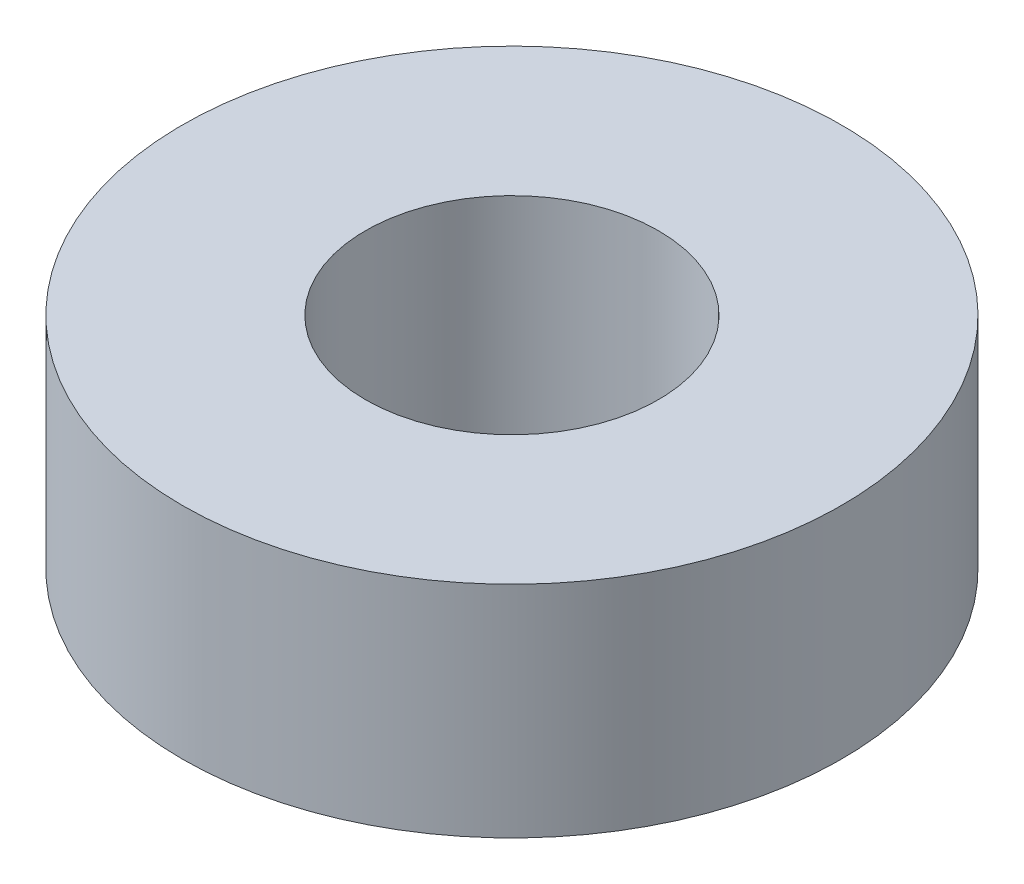
ISO-10303-21;
HEADER;
FILE_DESCRIPTION(('STEP AP214'),'2;1');
FILE_NAME('part.step','',(''),(''),'','','');
FILE_SCHEMA(('AUTOMOTIVE_DESIGN { 1 0 10303 214 1 1 1 1 }'));
ENDSEC;
DATA;
#1=APPLICATION_CONTEXT('core data for automotive mechanical design processes');
#2=APPLICATION_PROTOCOL_DEFINITION('international standard','automotive_design',2000,#1);
#3=PRODUCT_CONTEXT('',#1,'mechanical');
#4=PRODUCT('Part','Part','',(#3));
#5=PRODUCT_RELATED_PRODUCT_CATEGORY('part','',(#4));
#6=PRODUCT_DEFINITION_FORMATION('','',#4);
#7=PRODUCT_DEFINITION_CONTEXT('part definition',#1,'design');
#8=PRODUCT_DEFINITION('design','',#6,#7);
#9=PRODUCT_DEFINITION_SHAPE('','',#8);
#10=(LENGTH_UNIT() NAMED_UNIT(*) SI_UNIT(.MILLI.,.METRE.));
#11=(NAMED_UNIT(*) PLANE_ANGLE_UNIT() SI_UNIT($,.RADIAN.));
#12=(NAMED_UNIT(*) SI_UNIT($,.STERADIAN.) SOLID_ANGLE_UNIT());
#13=UNCERTAINTY_MEASURE_WITH_UNIT(LENGTH_MEASURE(1.E-05),#10,'distance_accuracy_value','');
#14=(GEOMETRIC_REPRESENTATION_CONTEXT(3) GLOBAL_UNCERTAINTY_ASSIGNED_CONTEXT((#13)) GLOBAL_UNIT_ASSIGNED_CONTEXT((#10,
#11,#12)) REPRESENTATION_CONTEXT('',''));
#15=CARTESIAN_POINT('',(0.,0.,0.));
#16=DIRECTION('',(0.,0.,1.));
#17=DIRECTION('',(1.,0.,0.));
#18=AXIS2_PLACEMENT_3D('',#15,#16,#17);
#19=CARTESIAN_POINT('',(0.,15.,0.));
#20=DIRECTION('',(0.,-1.,0.));
#21=DIRECTION('',(0.,0.,-1.));
#22=AXIS2_PLACEMENT_3D('',#19,#20,#21);
#23=CYLINDRICAL_SURFACE('',#22,22.5);
#24=CARTESIAN_POINT('',(0.,15.,0.));
#25=DIRECTION('',(0.,1.,0.));
#26=DIRECTION('',(0.,0.,1.));
#27=AXIS2_PLACEMENT_3D('',#24,#25,#26);
#28=CIRCLE('',#27,22.5);
#29=CARTESIAN_POINT('',(0.,15.,22.5));
#30=VERTEX_POINT('',#29);
#31=EDGE_CURVE('E10',#30,#30,#28,.T.);
#32=ORIENTED_EDGE('',*,*,#31,.F.);
#33=EDGE_LOOP('',(#32));
#34=FACE_BOUND('',#33,.T.);
#35=CARTESIAN_POINT('',(0.,0.,0.));
#36=DIRECTION('',(0.,1.,0.));
#37=DIRECTION('',(0.,0.,1.));
#38=AXIS2_PLACEMENT_3D('',#35,#36,#37);
#39=CIRCLE('',#38,22.5);
#40=CARTESIAN_POINT('',(0.,0.,22.5));
#41=VERTEX_POINT('',#40);
#42=EDGE_CURVE('E37',#41,#41,#39,.T.);
#43=ORIENTED_EDGE('',*,*,#42,.T.);
#44=EDGE_LOOP('',(#43));
#45=FACE_BOUND('',#44,.T.);
#46=ADVANCED_FACE('F40',(#34,#45),#23,.T.);
#47=CARTESIAN_POINT('',(0.,15.,0.));
#48=DIRECTION('',(0.,1.,0.));
#49=DIRECTION('',(0.,0.,1.));
#50=AXIS2_PLACEMENT_3D('',#47,#48,#49);
#51=PLANE('',#50);
#52=CARTESIAN_POINT('',(0.,15.,0.));
#53=DIRECTION('',(0.,1.,0.));
#54=DIRECTION('',(0.,0.,1.));
#55=AXIS2_PLACEMENT_3D('',#52,#53,#54);
#56=CIRCLE('',#55,10.);
#57=CARTESIAN_POINT('',(0.,15.,10.));
#58=VERTEX_POINT('',#57);
#59=EDGE_CURVE('E50',#58,#58,#56,.T.);
#60=ORIENTED_EDGE('',*,*,#59,.F.);
#61=EDGE_LOOP('',(#60));
#62=FACE_BOUND('',#61,.T.);
#63=ORIENTED_EDGE('',*,*,#31,.T.);
#64=EDGE_LOOP('',(#63));
#65=FACE_BOUND('',#64,.T.);
#66=ADVANCED_FACE('F59',(#62,#65),#51,.T.);
#67=CARTESIAN_POINT('',(0.,0.,0.));
#68=DIRECTION('',(0.,1.,0.));
#69=DIRECTION('',(0.,0.,1.));
#70=AXIS2_PLACEMENT_3D('',#67,#68,#69);
#71=PLANE('',#70);
#72=CARTESIAN_POINT('',(0.,0.,0.));
#73=DIRECTION('',(0.,1.,0.));
#74=DIRECTION('',(0.,0.,1.));
#75=AXIS2_PLACEMENT_3D('',#72,#73,#74);
#76=CIRCLE('',#75,10.);
#77=CARTESIAN_POINT('',(0.,0.,10.));
#78=VERTEX_POINT('',#77);
#79=EDGE_CURVE('E47',#78,#78,#76,.T.);
#80=ORIENTED_EDGE('',*,*,#79,.T.);
#81=EDGE_LOOP('',(#80));
#82=FACE_BOUND('',#81,.T.);
#83=ORIENTED_EDGE('',*,*,#42,.F.);
#84=EDGE_LOOP('',(#83));
#85=FACE_BOUND('',#84,.T.);
#86=ADVANCED_FACE('F58',(#82,#85),#71,.F.);
#87=CARTESIAN_POINT('',(0.,15.,0.));
#88=DIRECTION('',(0.,-1.,0.));
#89=DIRECTION('',(0.,0.,-1.));
#90=AXIS2_PLACEMENT_3D('',#87,#88,#89);
#91=CYLINDRICAL_SURFACE('',#90,10.);
#92=ORIENTED_EDGE('',*,*,#59,.T.);
#93=EDGE_LOOP('',(#92));
#94=FACE_BOUND('',#93,.T.);
#95=ORIENTED_EDGE('',*,*,#79,.F.);
#96=EDGE_LOOP('',(#95));
#97=FACE_BOUND('',#96,.T.);
#98=ADVANCED_FACE('F54',(#94,#97),#91,.F.);
#99=CLOSED_SHELL('',(#46,#66,#86,#98));
#100=MANIFOLD_SOLID_BREP('B2',#99);
#101=ADVANCED_BREP_SHAPE_REPRESENTATION('',(#18,#100),#14);
#102=SHAPE_DEFINITION_REPRESENTATION(#9,#101);
ENDSEC;
END-ISO-10303-21;
